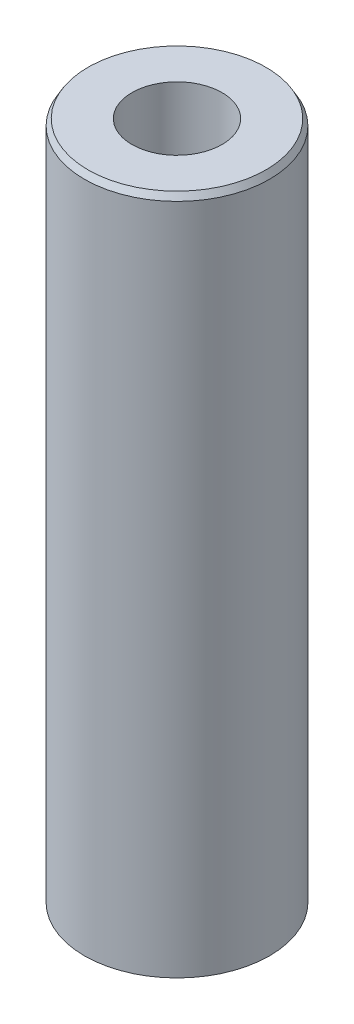
ISO-10303-21;
HEADER;
FILE_DESCRIPTION(('STEP AP214'),'2;1');
FILE_NAME('part.step','',(''),(''),'','','');
FILE_SCHEMA(('AUTOMOTIVE_DESIGN { 1 0 10303 214 1 1 1 1 }'));
ENDSEC;
DATA;
#1=APPLICATION_CONTEXT('core data for automotive mechanical design processes');
#2=APPLICATION_PROTOCOL_DEFINITION('international standard','automotive_design',2000,#1);
#3=PRODUCT_CONTEXT('',#1,'mechanical');
#4=PRODUCT('Part','Part','',(#3));
#5=PRODUCT_RELATED_PRODUCT_CATEGORY('part','',(#4));
#6=PRODUCT_DEFINITION_FORMATION('','',#4);
#7=PRODUCT_DEFINITION_CONTEXT('part definition',#1,'design');
#8=PRODUCT_DEFINITION('design','',#6,#7);
#9=PRODUCT_DEFINITION_SHAPE('','',#8);
#10=(LENGTH_UNIT() NAMED_UNIT(*) SI_UNIT(.MILLI.,.METRE.));
#11=(NAMED_UNIT(*) PLANE_ANGLE_UNIT() SI_UNIT($,.RADIAN.));
#12=(NAMED_UNIT(*) SI_UNIT($,.STERADIAN.) SOLID_ANGLE_UNIT());
#13=UNCERTAINTY_MEASURE_WITH_UNIT(LENGTH_MEASURE(1.E-05),#10,'distance_accuracy_value','');
#14=(GEOMETRIC_REPRESENTATION_CONTEXT(3) GLOBAL_UNCERTAINTY_ASSIGNED_CONTEXT((#13)) GLOBAL_UNIT_ASSIGNED_CONTEXT((#10,
#11,#12)) REPRESENTATION_CONTEXT('',''));
#15=CARTESIAN_POINT('',(0.,0.,0.));
#16=DIRECTION('',(0.,0.,1.));
#17=DIRECTION('',(1.,0.,0.));
#18=AXIS2_PLACEMENT_3D('',#15,#16,#17);
#19=CARTESIAN_POINT('',(0.,73.7155178287194,0.));
#20=DIRECTION('',(0.,-1.,0.));
#21=DIRECTION('',(0.,0.,-1.));
#22=AXIS2_PLACEMENT_3D('',#19,#20,#21);
#23=CYLINDRICAL_SURFACE('',#22,10.);
#24=CARTESIAN_POINT('',(0.,73.0353570050396,0.));
#25=DIRECTION('',(0.,1.,0.));
#26=DIRECTION('',(0.,0.,1.));
#27=AXIS2_PLACEMENT_3D('',#24,#25,#26);
#28=CIRCLE('',#27,10.);
#29=CARTESIAN_POINT('',(0.,73.0353570050396,10.));
#30=VERTEX_POINT('',#29);
#31=EDGE_CURVE('E50',#30,#30,#28,.F.);
#32=ORIENTED_EDGE('',*,*,#31,.T.);
#33=EDGE_LOOP('',(#32));
#34=FACE_BOUND('',#33,.T.);
#35=CARTESIAN_POINT('',(0.,0.392691034643775,0.));
#36=DIRECTION('',(0.,1.,0.));
#37=DIRECTION('',(0.,0.,1.));
#38=AXIS2_PLACEMENT_3D('',#35,#36,#37);
#39=CIRCLE('',#38,10.);
#40=CARTESIAN_POINT('',(0.,0.392691034643775,10.));
#41=VERTEX_POINT('',#40);
#42=EDGE_CURVE('E51',#41,#41,#39,.T.);
#43=ORIENTED_EDGE('',*,*,#42,.T.);
#44=EDGE_LOOP('',(#43));
#45=FACE_BOUND('',#44,.T.);
#46=ADVANCED_FACE('F39',(#34,#45),#23,.T.);
#47=CARTESIAN_POINT('',(0.,73.7155178287194,0.));
#48=DIRECTION('',(0.,1.,0.));
#49=DIRECTION('',(0.,0.,1.));
#50=AXIS2_PLACEMENT_3D('',#47,#48,#49);
#51=PLANE('',#50);
#52=CARTESIAN_POINT('',(0.,73.7155178287194,0.));
#53=DIRECTION('',(0.,1.,0.));
#54=DIRECTION('',(0.,0.,1.));
#55=AXIS2_PLACEMENT_3D('',#52,#53,#54);
#56=CIRCLE('',#55,9.60730896535621);
#57=CARTESIAN_POINT('',(0.,73.7155178287194,9.60730896535621));
#58=VERTEX_POINT('',#57);
#59=EDGE_CURVE('E54',#58,#58,#56,.T.);
#60=ORIENTED_EDGE('',*,*,#59,.T.);
#61=EDGE_LOOP('',(#60));
#62=FACE_BOUND('',#61,.T.);
#63=CARTESIAN_POINT('',(0.,73.7155178287194,0.));
#64=DIRECTION('',(0.,1.,0.));
#65=DIRECTION('',(0.,0.,1.));
#66=AXIS2_PLACEMENT_3D('',#63,#64,#65);
#67=CIRCLE('',#66,4.86370778465542);
#68=CARTESIAN_POINT('',(0.,73.7155178287194,4.86370778465542));
#69=VERTEX_POINT('',#68);
#70=EDGE_CURVE('E58',#69,#69,#67,.T.);
#71=ORIENTED_EDGE('',*,*,#70,.F.);
#72=EDGE_LOOP('',(#71));
#73=FACE_BOUND('',#72,.T.);
#74=ADVANCED_FACE('F69',(#62,#73),#51,.T.);
#75=CARTESIAN_POINT('',(0.,0.,0.));
#76=DIRECTION('',(0.,1.,0.));
#77=DIRECTION('',(0.,0.,1.));
#78=AXIS2_PLACEMENT_3D('',#75,#76,#77);
#79=PLANE('',#78);
#80=CARTESIAN_POINT('',(0.,0.,0.));
#81=DIRECTION('',(0.,1.,0.));
#82=DIRECTION('',(0.,0.,1.));
#83=AXIS2_PLACEMENT_3D('',#80,#81,#82);
#84=CIRCLE('',#83,9.31983917632018);
#85=CARTESIAN_POINT('',(0.,0.,9.31983917632018));
#86=VERTEX_POINT('',#85);
#87=EDGE_CURVE('E10',#86,#86,#84,.F.);
#88=ORIENTED_EDGE('',*,*,#87,.T.);
#89=EDGE_LOOP('',(#88));
#90=FACE_BOUND('',#89,.T.);
#91=CARTESIAN_POINT('',(0.,0.,0.));
#92=DIRECTION('',(0.,1.,0.));
#93=DIRECTION('',(0.,0.,1.));
#94=AXIS2_PLACEMENT_3D('',#91,#92,#93);
#95=CIRCLE('',#94,4.86370778465542);
#96=CARTESIAN_POINT('',(0.,0.,4.86370778465542));
#97=VERTEX_POINT('',#96);
#98=EDGE_CURVE('E63',#97,#97,#95,.T.);
#99=ORIENTED_EDGE('',*,*,#98,.T.);
#100=EDGE_LOOP('',(#99));
#101=FACE_BOUND('',#100,.T.);
#102=ADVANCED_FACE('F75',(#90,#101),#79,.F.);
#103=CARTESIAN_POINT('',(0.,73.7155178287194,0.));
#104=DIRECTION('',(0.,-1.,0.));
#105=DIRECTION('',(0.,0.,-1.));
#106=AXIS2_PLACEMENT_3D('',#103,#104,#105);
#107=CYLINDRICAL_SURFACE('',#106,4.86370778465542);
#108=ORIENTED_EDGE('',*,*,#70,.T.);
#109=EDGE_LOOP('',(#108));
#110=FACE_BOUND('',#109,.T.);
#111=ORIENTED_EDGE('',*,*,#98,.F.);
#112=EDGE_LOOP('',(#111));
#113=FACE_BOUND('',#112,.T.);
#114=ADVANCED_FACE('F70',(#110,#113),#107,.F.);
#115=CARTESIAN_POINT('',(0.,73.7155178287194,0.));
#116=DIRECTION('',(0.,-1.,0.));
#117=DIRECTION('',(0.,0.,-1.));
#118=AXIS2_PLACEMENT_3D('',#115,#116,#117);
#119=CONICAL_SURFACE('',#118,9.60730896535621,0.523598775598288);
#120=ORIENTED_EDGE('',*,*,#31,.F.);
#121=EDGE_LOOP('',(#120));
#122=FACE_BOUND('',#121,.T.);
#123=ORIENTED_EDGE('',*,*,#59,.F.);
#124=EDGE_LOOP('',(#123));
#125=FACE_BOUND('',#124,.T.);
#126=ADVANCED_FACE('F81',(#122,#125),#119,.T.);
#127=CARTESIAN_POINT('',(0.,0.392691034643775,0.));
#128=DIRECTION('',(0.,1.,0.));
#129=DIRECTION('',(0.,0.,1.));
#130=AXIS2_PLACEMENT_3D('',#127,#128,#129);
#131=CONICAL_SURFACE('',#130,10.,1.0471975511966);
#132=ORIENTED_EDGE('',*,*,#87,.F.);
#133=EDGE_LOOP('',(#132));
#134=FACE_BOUND('',#133,.T.);
#135=ORIENTED_EDGE('',*,*,#42,.F.);
#136=EDGE_LOOP('',(#135));
#137=FACE_BOUND('',#136,.T.);
#138=ADVANCED_FACE('F45',(#134,#137),#131,.T.);
#139=CLOSED_SHELL('',(#46,#74,#102,#114,#126,#138));
#140=MANIFOLD_SOLID_BREP('B2',#139);
#141=ADVANCED_BREP_SHAPE_REPRESENTATION('',(#18,#140),#14);
#142=SHAPE_DEFINITION_REPRESENTATION(#9,#141);
ENDSEC;
END-ISO-10303-21;
